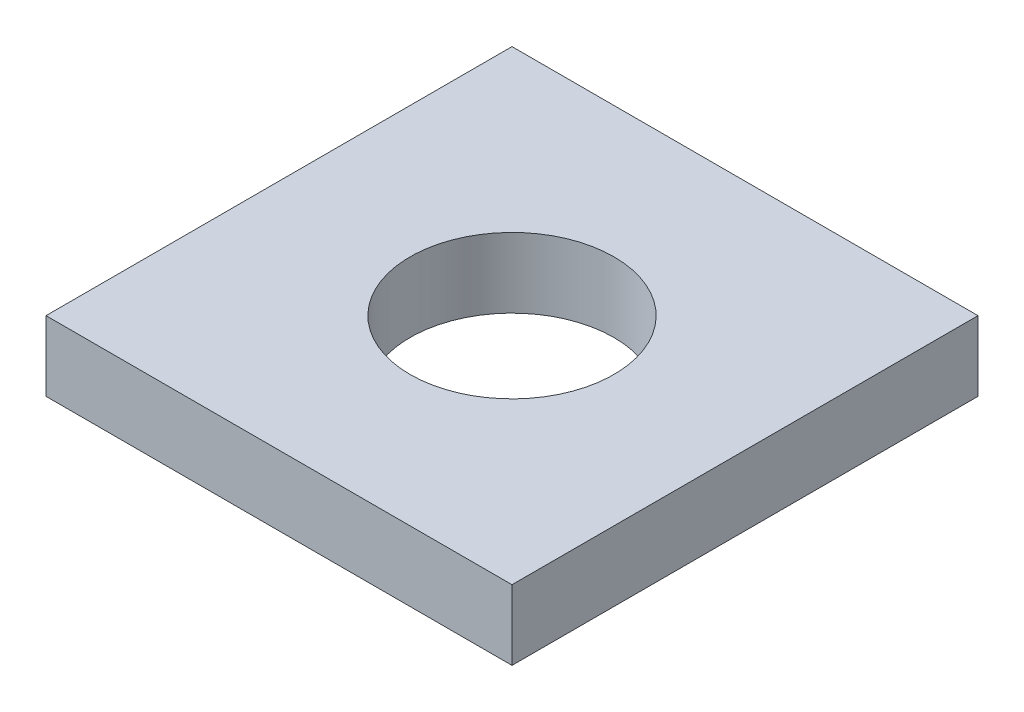
ISO-10303-21;
HEADER;
FILE_DESCRIPTION(('STEP AP214'),'2;1');
FILE_NAME('part.step','',(''),(''),'','','');
FILE_SCHEMA(('AUTOMOTIVE_DESIGN { 1 0 10303 214 1 1 1 1 }'));
ENDSEC;
DATA;
#1=APPLICATION_CONTEXT('core data for automotive mechanical design processes');
#2=APPLICATION_PROTOCOL_DEFINITION('international standard','automotive_design',2000,#1);
#3=PRODUCT_CONTEXT('',#1,'mechanical');
#4=PRODUCT('Part','Part','',(#3));
#5=PRODUCT_RELATED_PRODUCT_CATEGORY('part','',(#4));
#6=PRODUCT_DEFINITION_FORMATION('','',#4);
#7=PRODUCT_DEFINITION_CONTEXT('part definition',#1,'design');
#8=PRODUCT_DEFINITION('design','',#6,#7);
#9=PRODUCT_DEFINITION_SHAPE('','',#8);
#10=(LENGTH_UNIT() NAMED_UNIT(*) SI_UNIT(.MILLI.,.METRE.));
#11=(NAMED_UNIT(*) PLANE_ANGLE_UNIT() SI_UNIT($,.RADIAN.));
#12=(NAMED_UNIT(*) SI_UNIT($,.STERADIAN.) SOLID_ANGLE_UNIT());
#13=UNCERTAINTY_MEASURE_WITH_UNIT(LENGTH_MEASURE(1.E-05),#10,'distance_accuracy_value','');
#14=(GEOMETRIC_REPRESENTATION_CONTEXT(3) GLOBAL_UNCERTAINTY_ASSIGNED_CONTEXT((#13)) GLOBAL_UNIT_ASSIGNED_CONTEXT((#10,
#11,#12)) REPRESENTATION_CONTEXT('',''));
#15=CARTESIAN_POINT('',(0.,0.,0.));
#16=DIRECTION('',(0.,0.,1.));
#17=DIRECTION('',(1.,0.,0.));
#18=AXIS2_PLACEMENT_3D('',#15,#16,#17);
#19=CARTESIAN_POINT('',(0.,6.,0.));
#20=DIRECTION('',(0.,-1.,0.));
#21=DIRECTION('',(0.,0.,-1.));
#22=AXIS2_PLACEMENT_3D('',#19,#20,#21);
#23=PLANE('',#22);
#24=DIRECTION('',(0.,0.,-1.));
#25=VECTOR('',#24,1.);
#26=CARTESIAN_POINT('',(20.,6.,20.));
#27=LINE('',#26,#25);
#28=CARTESIAN_POINT('',(20.,6.,20.));
#29=VERTEX_POINT('',#28);
#30=CARTESIAN_POINT('',(20.,6.,-20.));
#31=VERTEX_POINT('',#30);
#32=EDGE_CURVE('E92',#29,#31,#27,.T.);
#33=ORIENTED_EDGE('',*,*,#32,.T.);
#34=DIRECTION('',(-1.,0.,0.));
#35=VECTOR('',#34,1.);
#36=CARTESIAN_POINT('',(-20.,6.,-20.));
#37=LINE('',#36,#35);
#38=CARTESIAN_POINT('',(-20.,6.,-20.));
#39=VERTEX_POINT('',#38);
#40=EDGE_CURVE('E87',#31,#39,#37,.T.);
#41=ORIENTED_EDGE('',*,*,#40,.T.);
#42=DIRECTION('',(0.,0.,1.));
#43=VECTOR('',#42,1.);
#44=CARTESIAN_POINT('',(-20.,6.,20.));
#45=LINE('',#44,#43);
#46=CARTESIAN_POINT('',(-20.,6.,20.));
#47=VERTEX_POINT('',#46);
#48=EDGE_CURVE('E90',#39,#47,#45,.T.);
#49=ORIENTED_EDGE('',*,*,#48,.T.);
#50=DIRECTION('',(1.,0.,0.));
#51=VECTOR('',#50,1.);
#52=CARTESIAN_POINT('',(-20.,6.,20.));
#53=LINE('',#52,#51);
#54=EDGE_CURVE('E57',#47,#29,#53,.T.);
#55=ORIENTED_EDGE('',*,*,#54,.T.);
#56=EDGE_LOOP('',(#33,#41,#49,#55));
#57=FACE_BOUND('',#56,.T.);
#58=CARTESIAN_POINT('',(0.,6.,0.));
#59=DIRECTION('',(0.,1.,0.));
#60=DIRECTION('',(0.,0.,1.));
#61=AXIS2_PLACEMENT_3D('',#58,#59,#60);
#62=CIRCLE('',#61,8.75);
#63=CARTESIAN_POINT('',(0.,6.,8.75000000000001));
#64=VERTEX_POINT('',#63);
#65=EDGE_CURVE('E112',#64,#64,#62,.T.);
#66=ORIENTED_EDGE('',*,*,#65,.F.);
#67=EDGE_LOOP('',(#66));
#68=FACE_BOUND('',#67,.T.);
#69=ADVANCED_FACE('F39',(#57,#68),#23,.F.);
#70=CARTESIAN_POINT('',(0.,0.,0.));
#71=DIRECTION('',(0.,-1.,0.));
#72=DIRECTION('',(0.,0.,-1.));
#73=AXIS2_PLACEMENT_3D('',#70,#71,#72);
#74=PLANE('',#73);
#75=DIRECTION('',(0.,0.,-1.));
#76=VECTOR('',#75,1.);
#77=CARTESIAN_POINT('',(20.,0.,20.));
#78=LINE('',#77,#76);
#79=CARTESIAN_POINT('',(20.,0.,20.));
#80=VERTEX_POINT('',#79);
#81=CARTESIAN_POINT('',(20.,0.,-20.));
#82=VERTEX_POINT('',#81);
#83=EDGE_CURVE('E108',#80,#82,#78,.T.);
#84=ORIENTED_EDGE('',*,*,#83,.F.);
#85=DIRECTION('',(1.,0.,0.));
#86=VECTOR('',#85,1.);
#87=CARTESIAN_POINT('',(-20.,0.,20.));
#88=LINE('',#87,#86);
#89=CARTESIAN_POINT('',(-20.,0.,20.));
#90=VERTEX_POINT('',#89);
#91=EDGE_CURVE('E80',#90,#80,#88,.T.);
#92=ORIENTED_EDGE('',*,*,#91,.F.);
#93=DIRECTION('',(0.,0.,1.));
#94=VECTOR('',#93,1.);
#95=CARTESIAN_POINT('',(-20.,0.,20.));
#96=LINE('',#95,#94);
#97=CARTESIAN_POINT('',(-20.,0.,-20.));
#98=VERTEX_POINT('',#97);
#99=EDGE_CURVE('E74',#98,#90,#96,.T.);
#100=ORIENTED_EDGE('',*,*,#99,.F.);
#101=DIRECTION('',(-1.,0.,0.));
#102=VECTOR('',#101,1.);
#103=CARTESIAN_POINT('',(-20.,0.,-20.));
#104=LINE('',#103,#102);
#105=EDGE_CURVE('E97',#82,#98,#104,.T.);
#106=ORIENTED_EDGE('',*,*,#105,.F.);
#107=EDGE_LOOP('',(#84,#92,#100,#106));
#108=FACE_BOUND('',#107,.T.);
#109=CARTESIAN_POINT('',(0.,0.,0.));
#110=DIRECTION('',(0.,1.,0.));
#111=DIRECTION('',(0.,0.,1.));
#112=AXIS2_PLACEMENT_3D('',#109,#110,#111);
#113=CIRCLE('',#112,8.75);
#114=CARTESIAN_POINT('',(0.,0.,8.75000000000001));
#115=VERTEX_POINT('',#114);
#116=EDGE_CURVE('E130',#115,#115,#113,.T.);
#117=ORIENTED_EDGE('',*,*,#116,.T.);
#118=EDGE_LOOP('',(#117));
#119=FACE_BOUND('',#118,.T.);
#120=ADVANCED_FACE('F125',(#108,#119),#74,.T.);
#121=CARTESIAN_POINT('',(20.,6.,20.));
#122=DIRECTION('',(-1.,0.,0.));
#123=DIRECTION('',(0.,0.,1.));
#124=AXIS2_PLACEMENT_3D('',#121,#122,#123);
#125=PLANE('',#124);
#126=ORIENTED_EDGE('',*,*,#83,.T.);
#127=DIRECTION('',(0.,-1.,0.));
#128=VECTOR('',#127,1.);
#129=CARTESIAN_POINT('',(20.,6.,-20.));
#130=LINE('',#129,#128);
#131=EDGE_CURVE('E11',#31,#82,#130,.T.);
#132=ORIENTED_EDGE('',*,*,#131,.F.);
#133=ORIENTED_EDGE('',*,*,#32,.F.);
#134=DIRECTION('',(0.,-1.,0.));
#135=VECTOR('',#134,1.);
#136=CARTESIAN_POINT('',(20.,6.,20.));
#137=LINE('',#136,#135);
#138=EDGE_CURVE('E104',#29,#80,#137,.T.);
#139=ORIENTED_EDGE('',*,*,#138,.T.);
#140=EDGE_LOOP('',(#126,#132,#133,#139));
#141=FACE_BOUND('',#140,.T.);
#142=ADVANCED_FACE('F41',(#141),#125,.F.);
#143=CARTESIAN_POINT('',(-20.,6.,-20.));
#144=DIRECTION('',(0.,0.,1.));
#145=DIRECTION('',(1.,0.,0.));
#146=AXIS2_PLACEMENT_3D('',#143,#144,#145);
#147=PLANE('',#146);
#148=ORIENTED_EDGE('',*,*,#105,.T.);
#149=DIRECTION('',(0.,-1.,0.));
#150=VECTOR('',#149,1.);
#151=CARTESIAN_POINT('',(-20.,6.,-20.));
#152=LINE('',#151,#150);
#153=EDGE_CURVE('E49',#39,#98,#152,.T.);
#154=ORIENTED_EDGE('',*,*,#153,.F.);
#155=ORIENTED_EDGE('',*,*,#40,.F.);
#156=ORIENTED_EDGE('',*,*,#131,.T.);
#157=EDGE_LOOP('',(#148,#154,#155,#156));
#158=FACE_BOUND('',#157,.T.);
#159=ADVANCED_FACE('F96',(#158),#147,.F.);
#160=CARTESIAN_POINT('',(-20.,6.,20.));
#161=DIRECTION('',(1.,0.,0.));
#162=DIRECTION('',(0.,0.,-1.));
#163=AXIS2_PLACEMENT_3D('',#160,#161,#162);
#164=PLANE('',#163);
#165=ORIENTED_EDGE('',*,*,#99,.T.);
#166=DIRECTION('',(0.,-1.,0.));
#167=VECTOR('',#166,1.);
#168=CARTESIAN_POINT('',(-20.,6.,20.));
#169=LINE('',#168,#167);
#170=EDGE_CURVE('E99',#47,#90,#169,.T.);
#171=ORIENTED_EDGE('',*,*,#170,.F.);
#172=ORIENTED_EDGE('',*,*,#48,.F.);
#173=ORIENTED_EDGE('',*,*,#153,.T.);
#174=EDGE_LOOP('',(#165,#171,#172,#173));
#175=FACE_BOUND('',#174,.T.);
#176=ADVANCED_FACE('F100',(#175),#164,.F.);
#177=CARTESIAN_POINT('',(-20.,6.,20.));
#178=DIRECTION('',(0.,0.,-1.));
#179=DIRECTION('',(-1.,0.,0.));
#180=AXIS2_PLACEMENT_3D('',#177,#178,#179);
#181=PLANE('',#180);
#182=ORIENTED_EDGE('',*,*,#91,.T.);
#183=ORIENTED_EDGE('',*,*,#138,.F.);
#184=ORIENTED_EDGE('',*,*,#54,.F.);
#185=ORIENTED_EDGE('',*,*,#170,.T.);
#186=EDGE_LOOP('',(#182,#183,#184,#185));
#187=FACE_BOUND('',#186,.T.);
#188=ADVANCED_FACE('F122',(#187),#181,.F.);
#189=CARTESIAN_POINT('',(0.,6.,0.));
#190=DIRECTION('',(0.,-1.,0.));
#191=DIRECTION('',(0.,0.,-1.));
#192=AXIS2_PLACEMENT_3D('',#189,#190,#191);
#193=CYLINDRICAL_SURFACE('',#192,8.75);
#194=ORIENTED_EDGE('',*,*,#65,.T.);
#195=EDGE_LOOP('',(#194));
#196=FACE_BOUND('',#195,.T.);
#197=ORIENTED_EDGE('',*,*,#116,.F.);
#198=EDGE_LOOP('',(#197));
#199=FACE_BOUND('',#198,.T.);
#200=ADVANCED_FACE('F138',(#196,#199),#193,.F.);
#201=CLOSED_SHELL('',(#69,#120,#142,#159,#176,#188,#200));
#202=MANIFOLD_SOLID_BREP('B2',#201);
#203=ADVANCED_BREP_SHAPE_REPRESENTATION('',(#18,#202),#14);
#204=SHAPE_DEFINITION_REPRESENTATION(#9,#203);
ENDSEC;
END-ISO-10303-21;
